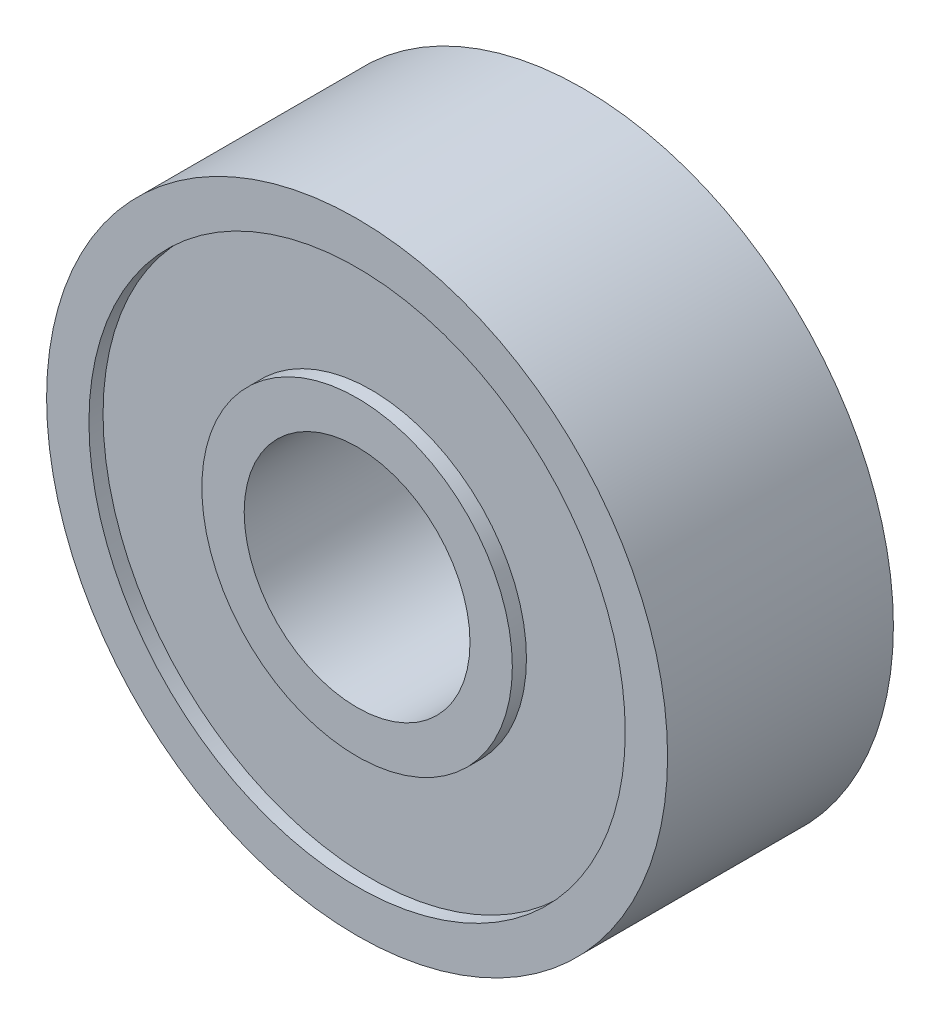
ISO-10303-21;
HEADER;
FILE_DESCRIPTION(('STEP AP214'),'2;1');
FILE_NAME('part.step','',(''),(''),'','','');
FILE_SCHEMA(('AUTOMOTIVE_DESIGN { 1 0 10303 214 1 1 1 1 }'));
ENDSEC;
DATA;
#1=APPLICATION_CONTEXT('core data for automotive mechanical design processes');
#2=APPLICATION_PROTOCOL_DEFINITION('international standard','automotive_design',2000,#1);
#3=PRODUCT_CONTEXT('',#1,'mechanical');
#4=PRODUCT('Part','Part','',(#3));
#5=PRODUCT_RELATED_PRODUCT_CATEGORY('part','',(#4));
#6=PRODUCT_DEFINITION_FORMATION('','',#4);
#7=PRODUCT_DEFINITION_CONTEXT('part definition',#1,'design');
#8=PRODUCT_DEFINITION('design','',#6,#7);
#9=PRODUCT_DEFINITION_SHAPE('','',#8);
#10=(LENGTH_UNIT() NAMED_UNIT(*) SI_UNIT(.MILLI.,.METRE.));
#11=(NAMED_UNIT(*) PLANE_ANGLE_UNIT() SI_UNIT($,.RADIAN.));
#12=(NAMED_UNIT(*) SI_UNIT($,.STERADIAN.) SOLID_ANGLE_UNIT());
#13=UNCERTAINTY_MEASURE_WITH_UNIT(LENGTH_MEASURE(1.E-05),#10,'distance_accuracy_value','');
#14=(GEOMETRIC_REPRESENTATION_CONTEXT(3) GLOBAL_UNCERTAINTY_ASSIGNED_CONTEXT((#13)) GLOBAL_UNIT_ASSIGNED_CONTEXT((#10,
#11,#12)) REPRESENTATION_CONTEXT('',''));
#15=CARTESIAN_POINT('',(0.,0.,0.));
#16=DIRECTION('',(0.,0.,1.));
#17=DIRECTION('',(1.,0.,0.));
#18=AXIS2_PLACEMENT_3D('',#15,#16,#17);
#19=CARTESIAN_POINT('',(0.,0.,-4.));
#20=DIRECTION('',(0.,0.,1.));
#21=DIRECTION('',(1.00000000000001,0.,0.));
#22=AXIS2_PLACEMENT_3D('',#19,#20,#21);
#23=CYLINDRICAL_SURFACE('',#22,9.5);
#24=CARTESIAN_POINT('',(0.,0.,-4.));
#25=DIRECTION('',(0.,0.,1.));
#26=DIRECTION('',(1.00000000000001,0.,0.));
#27=AXIS2_PLACEMENT_3D('',#24,#25,#26);
#28=CIRCLE('',#27,9.5);
#29=CARTESIAN_POINT('',(9.50000000000006,0.,-4.));
#30=VERTEX_POINT('',#29);
#31=EDGE_CURVE('E75',#30,#30,#28,.T.);
#32=ORIENTED_EDGE('',*,*,#31,.F.);
#33=EDGE_LOOP('',(#32));
#34=FACE_BOUND('',#33,.T.);
#35=CARTESIAN_POINT('',(0.,0.,-3.5));
#36=DIRECTION('',(0.,0.,1.));
#37=DIRECTION('',(1.00000000000001,0.,0.));
#38=AXIS2_PLACEMENT_3D('',#35,#36,#37);
#39=CIRCLE('',#38,9.5);
#40=CARTESIAN_POINT('',(9.50000000000006,0.,-3.5));
#41=VERTEX_POINT('',#40);
#42=EDGE_CURVE('E13',#41,#41,#39,.F.);
#43=ORIENTED_EDGE('',*,*,#42,.F.);
#44=EDGE_LOOP('',(#43));
#45=FACE_BOUND('',#44,.T.);
#46=ADVANCED_FACE('F64',(#34,#45),#23,.F.);
#47=CARTESIAN_POINT('',(0.,0.,3.5));
#48=DIRECTION('',(0.,0.,1.));
#49=DIRECTION('',(1.00000000000001,0.,0.));
#50=AXIS2_PLACEMENT_3D('',#47,#48,#49);
#51=CIRCLE('',#50,9.5);
#52=CARTESIAN_POINT('',(9.50000000000006,0.,3.5));
#53=VERTEX_POINT('',#52);
#54=EDGE_CURVE('E87',#53,#53,#51,.T.);
#55=ORIENTED_EDGE('',*,*,#54,.F.);
#56=EDGE_LOOP('',(#55));
#57=FACE_BOUND('',#56,.T.);
#58=CARTESIAN_POINT('',(0.,0.,3.99999999999984));
#59=DIRECTION('',(0.,0.,1.));
#60=DIRECTION('',(1.00000000000001,0.,0.));
#61=AXIS2_PLACEMENT_3D('',#58,#59,#60);
#62=CIRCLE('',#61,9.5);
#63=CARTESIAN_POINT('',(9.50000000000006,0.,3.99999999999984));
#64=VERTEX_POINT('',#63);
#65=EDGE_CURVE('E84',#64,#64,#62,.T.);
#66=ORIENTED_EDGE('',*,*,#65,.T.);
#67=EDGE_LOOP('',(#66));
#68=FACE_BOUND('',#67,.T.);
#69=ADVANCED_FACE('F66',(#57,#68),#23,.F.);
#70=CARTESIAN_POINT('',(0.,0.,-4.));
#71=DIRECTION('',(0.,0.,1.));
#72=DIRECTION('',(1.00000000000001,0.,0.));
#73=AXIS2_PLACEMENT_3D('',#70,#71,#72);
#74=CYLINDRICAL_SURFACE('',#73,11.);
#75=CARTESIAN_POINT('',(0.,0.,-4.));
#76=DIRECTION('',(0.,0.,1.));
#77=DIRECTION('',(1.00000000000001,0.,0.));
#78=AXIS2_PLACEMENT_3D('',#75,#76,#77);
#79=CIRCLE('',#78,11.);
#80=CARTESIAN_POINT('',(11.0000000000001,0.,-4.));
#81=VERTEX_POINT('',#80);
#82=EDGE_CURVE('E71',#81,#81,#79,.T.);
#83=ORIENTED_EDGE('',*,*,#82,.T.);
#84=EDGE_LOOP('',(#83));
#85=FACE_BOUND('',#84,.T.);
#86=CARTESIAN_POINT('',(0.,0.,3.99999999999984));
#87=DIRECTION('',(0.,0.,1.));
#88=DIRECTION('',(1.00000000000001,0.,0.));
#89=AXIS2_PLACEMENT_3D('',#86,#87,#88);
#90=CIRCLE('',#89,11.);
#91=CARTESIAN_POINT('',(11.0000000000001,0.,3.99999999999984));
#92=VERTEX_POINT('',#91);
#93=EDGE_CURVE('E79',#92,#92,#90,.T.);
#94=ORIENTED_EDGE('',*,*,#93,.F.);
#95=EDGE_LOOP('',(#94));
#96=FACE_BOUND('',#95,.T.);
#97=ADVANCED_FACE('F139',(#85,#96),#74,.T.);
#98=CARTESIAN_POINT('',(0.,0.,-4.));
#99=DIRECTION('',(0.,0.,1.));
#100=DIRECTION('',(1.00000000000001,0.,0.));
#101=AXIS2_PLACEMENT_3D('',#98,#99,#100);
#102=PLANE('',#101);
#103=ORIENTED_EDGE('',*,*,#31,.T.);
#104=EDGE_LOOP('',(#103));
#105=FACE_BOUND('',#104,.T.);
#106=ORIENTED_EDGE('',*,*,#82,.F.);
#107=EDGE_LOOP('',(#106));
#108=FACE_BOUND('',#107,.T.);
#109=ADVANCED_FACE('F144',(#105,#108),#102,.F.);
#110=CARTESIAN_POINT('',(0.,0.,3.99999999999984));
#111=DIRECTION('',(0.,0.,1.));
#112=DIRECTION('',(1.00000000000001,0.,0.));
#113=AXIS2_PLACEMENT_3D('',#110,#111,#112);
#114=PLANE('',#113);
#115=ORIENTED_EDGE('',*,*,#65,.F.);
#116=EDGE_LOOP('',(#115));
#117=FACE_BOUND('',#116,.T.);
#118=ORIENTED_EDGE('',*,*,#93,.T.);
#119=EDGE_LOOP('',(#118));
#120=FACE_BOUND('',#119,.T.);
#121=ADVANCED_FACE('F147',(#117,#120),#114,.T.);
#122=CARTESIAN_POINT('',(0.,0.,-3.5));
#123=DIRECTION('',(0.,0.,1.));
#124=DIRECTION('',(1.00000000000001,0.,0.));
#125=AXIS2_PLACEMENT_3D('',#122,#123,#124);
#126=PLANE('',#125);
#127=CARTESIAN_POINT('',(0.,0.,-3.5));
#128=DIRECTION('',(0.,0.,1.));
#129=DIRECTION('',(1.00000000000001,0.,0.));
#130=AXIS2_PLACEMENT_3D('',#127,#128,#129);
#131=CIRCLE('',#130,5.5);
#132=CARTESIAN_POINT('',(5.50000000000003,0.,-3.5));
#133=VERTEX_POINT('',#132);
#134=EDGE_CURVE('E93',#133,#133,#131,.T.);
#135=ORIENTED_EDGE('',*,*,#134,.T.);
#136=EDGE_LOOP('',(#135));
#137=FACE_BOUND('',#136,.T.);
#138=ORIENTED_EDGE('',*,*,#42,.T.);
#139=EDGE_LOOP('',(#138));
#140=FACE_BOUND('',#139,.T.);
#141=ADVANCED_FACE('F153',(#137,#140),#126,.F.);
#142=CARTESIAN_POINT('',(0.,0.,3.5));
#143=DIRECTION('',(0.,0.,1.));
#144=DIRECTION('',(1.00000000000001,0.,0.));
#145=AXIS2_PLACEMENT_3D('',#142,#143,#144);
#146=PLANE('',#145);
#147=CARTESIAN_POINT('',(0.,0.,3.5));
#148=DIRECTION('',(0.,0.,1.));
#149=DIRECTION('',(1.00000000000001,0.,0.));
#150=AXIS2_PLACEMENT_3D('',#147,#148,#149);
#151=CIRCLE('',#150,5.5);
#152=CARTESIAN_POINT('',(5.50000000000003,0.,3.5));
#153=VERTEX_POINT('',#152);
#154=EDGE_CURVE('E90',#153,#153,#151,.T.);
#155=ORIENTED_EDGE('',*,*,#154,.F.);
#156=EDGE_LOOP('',(#155));
#157=FACE_BOUND('',#156,.T.);
#158=ORIENTED_EDGE('',*,*,#54,.T.);
#159=EDGE_LOOP('',(#158));
#160=FACE_BOUND('',#159,.T.);
#161=ADVANCED_FACE('F132',(#157,#160),#146,.T.);
#162=CARTESIAN_POINT('',(0.,0.,-4.));
#163=DIRECTION('',(0.,0.,1.));
#164=DIRECTION('',(1.00000000000001,0.,0.));
#165=AXIS2_PLACEMENT_3D('',#162,#163,#164);
#166=CYLINDRICAL_SURFACE('',#165,5.5);
#167=CARTESIAN_POINT('',(0.,0.,-4.));
#168=DIRECTION('',(0.,0.,1.));
#169=DIRECTION('',(1.00000000000001,0.,0.));
#170=AXIS2_PLACEMENT_3D('',#167,#168,#169);
#171=CIRCLE('',#170,5.5);
#172=CARTESIAN_POINT('',(5.50000000000003,0.,-4.));
#173=VERTEX_POINT('',#172);
#174=EDGE_CURVE('E96',#173,#173,#171,.T.);
#175=ORIENTED_EDGE('',*,*,#174,.T.);
#176=EDGE_LOOP('',(#175));
#177=FACE_BOUND('',#176,.T.);
#178=ORIENTED_EDGE('',*,*,#134,.F.);
#179=EDGE_LOOP('',(#178));
#180=FACE_BOUND('',#179,.T.);
#181=ADVANCED_FACE('F122',(#177,#180),#166,.T.);
#182=CARTESIAN_POINT('',(0.,0.,-4.));
#183=DIRECTION('',(0.,0.,1.));
#184=DIRECTION('',(1.00000000000001,0.,0.));
#185=AXIS2_PLACEMENT_3D('',#182,#183,#184);
#186=CYLINDRICAL_SURFACE('',#185,4.);
#187=CARTESIAN_POINT('',(0.,0.,-4.));
#188=DIRECTION('',(0.,0.,1.));
#189=DIRECTION('',(1.00000000000001,0.,0.));
#190=AXIS2_PLACEMENT_3D('',#187,#188,#189);
#191=CIRCLE('',#190,4.);
#192=CARTESIAN_POINT('',(4.00000000000002,0.,-4.));
#193=VERTEX_POINT('',#192);
#194=EDGE_CURVE('E99',#193,#193,#191,.T.);
#195=ORIENTED_EDGE('',*,*,#194,.F.);
#196=EDGE_LOOP('',(#195));
#197=FACE_BOUND('',#196,.T.);
#198=CARTESIAN_POINT('',(0.,0.,3.99999999999984));
#199=DIRECTION('',(0.,0.,1.));
#200=DIRECTION('',(1.00000000000001,0.,0.));
#201=AXIS2_PLACEMENT_3D('',#198,#199,#200);
#202=CIRCLE('',#201,4.);
#203=CARTESIAN_POINT('',(4.00000000000002,0.,3.99999999999984));
#204=VERTEX_POINT('',#203);
#205=EDGE_CURVE('E105',#204,#204,#202,.T.);
#206=ORIENTED_EDGE('',*,*,#205,.T.);
#207=EDGE_LOOP('',(#206));
#208=FACE_BOUND('',#207,.T.);
#209=ADVANCED_FACE('F109',(#197,#208),#186,.F.);
#210=ORIENTED_EDGE('',*,*,#154,.T.);
#211=EDGE_LOOP('',(#210));
#212=FACE_BOUND('',#211,.T.);
#213=CARTESIAN_POINT('',(0.,0.,3.99999999999984));
#214=DIRECTION('',(0.,0.,1.));
#215=DIRECTION('',(1.00000000000001,0.,0.));
#216=AXIS2_PLACEMENT_3D('',#213,#214,#215);
#217=CIRCLE('',#216,5.5);
#218=CARTESIAN_POINT('',(5.50000000000003,0.,3.99999999999984));
#219=VERTEX_POINT('',#218);
#220=EDGE_CURVE('E102',#219,#219,#217,.T.);
#221=ORIENTED_EDGE('',*,*,#220,.F.);
#222=EDGE_LOOP('',(#221));
#223=FACE_BOUND('',#222,.T.);
#224=ADVANCED_FACE('F118',(#212,#223),#166,.T.);
#225=CARTESIAN_POINT('',(0.,0.,-4.));
#226=DIRECTION('',(0.,0.,1.));
#227=DIRECTION('',(1.00000000000001,0.,0.));
#228=AXIS2_PLACEMENT_3D('',#225,#226,#227);
#229=PLANE('',#228);
#230=ORIENTED_EDGE('',*,*,#194,.T.);
#231=EDGE_LOOP('',(#230));
#232=FACE_BOUND('',#231,.T.);
#233=ORIENTED_EDGE('',*,*,#174,.F.);
#234=EDGE_LOOP('',(#233));
#235=FACE_BOUND('',#234,.T.);
#236=ADVANCED_FACE('F114',(#232,#235),#229,.F.);
#237=CARTESIAN_POINT('',(0.,0.,3.99999999999984));
#238=DIRECTION('',(0.,0.,1.));
#239=DIRECTION('',(1.00000000000001,0.,0.));
#240=AXIS2_PLACEMENT_3D('',#237,#238,#239);
#241=PLANE('',#240);
#242=ORIENTED_EDGE('',*,*,#205,.F.);
#243=EDGE_LOOP('',(#242));
#244=FACE_BOUND('',#243,.T.);
#245=ORIENTED_EDGE('',*,*,#220,.T.);
#246=EDGE_LOOP('',(#245));
#247=FACE_BOUND('',#246,.T.);
#248=ADVANCED_FACE('F111',(#244,#247),#241,.T.);
#249=CLOSED_SHELL('',(#46,#69,#97,#109,#121,#141,#161,#181,#209,#224,#236,#248));
#250=MANIFOLD_SOLID_BREP('B2',#249);
#251=ADVANCED_BREP_SHAPE_REPRESENTATION('',(#18,#250),#14);
#252=SHAPE_DEFINITION_REPRESENTATION(#9,#251);
ENDSEC;
END-ISO-10303-21;
